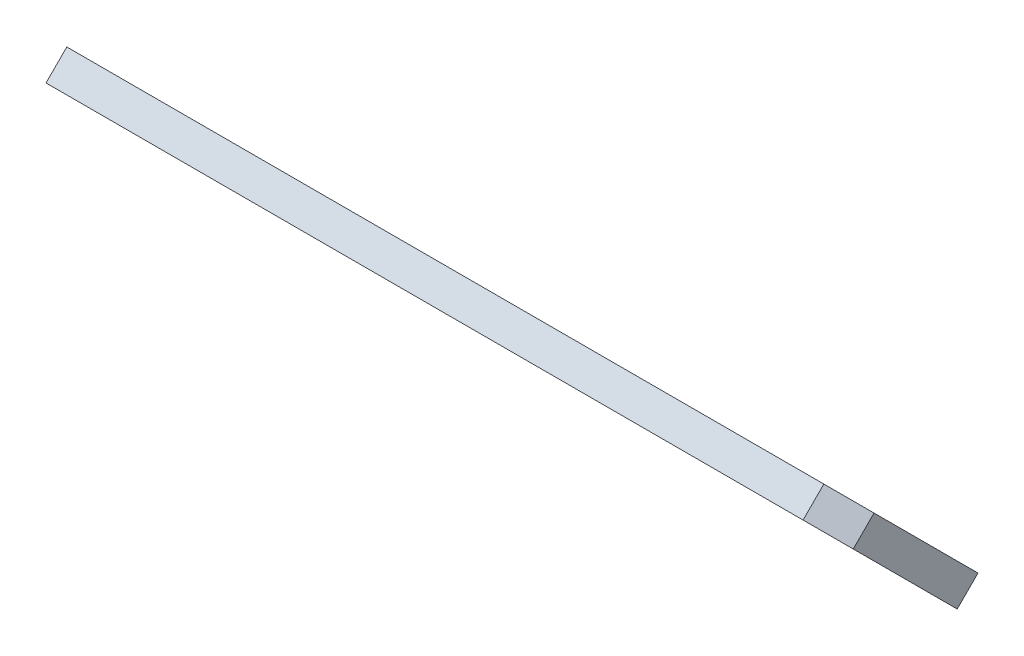
ISO-10303-21;
HEADER;
FILE_DESCRIPTION(('STEP AP214'),'2;1');
FILE_NAME('part.step','',(''),(''),'','','');
FILE_SCHEMA(('AUTOMOTIVE_DESIGN { 1 0 10303 214 1 1 1 1 }'));
ENDSEC;
DATA;
#1=APPLICATION_CONTEXT('core data for automotive mechanical design processes');
#2=APPLICATION_PROTOCOL_DEFINITION('international standard','automotive_design',2000,#1);
#3=PRODUCT_CONTEXT('',#1,'mechanical');
#4=PRODUCT('Part','Part','',(#3));
#5=PRODUCT_RELATED_PRODUCT_CATEGORY('part','',(#4));
#6=PRODUCT_DEFINITION_FORMATION('','',#4);
#7=PRODUCT_DEFINITION_CONTEXT('part definition',#1,'design');
#8=PRODUCT_DEFINITION('design','',#6,#7);
#9=PRODUCT_DEFINITION_SHAPE('','',#8);
#10=(LENGTH_UNIT() NAMED_UNIT(*) SI_UNIT(.MILLI.,.METRE.));
#11=(NAMED_UNIT(*) PLANE_ANGLE_UNIT() SI_UNIT($,.RADIAN.));
#12=(NAMED_UNIT(*) SI_UNIT($,.STERADIAN.) SOLID_ANGLE_UNIT());
#13=UNCERTAINTY_MEASURE_WITH_UNIT(LENGTH_MEASURE(1.E-05),#10,'distance_accuracy_value','');
#14=(GEOMETRIC_REPRESENTATION_CONTEXT(3) GLOBAL_UNCERTAINTY_ASSIGNED_CONTEXT((#13)) GLOBAL_UNIT_ASSIGNED_CONTEXT((#10,
#11,#12)) REPRESENTATION_CONTEXT('',''));
#15=CARTESIAN_POINT('',(0.,0.,0.));
#16=DIRECTION('',(0.,0.,1.));
#17=DIRECTION('',(1.,0.,0.));
#18=AXIS2_PLACEMENT_3D('',#15,#16,#17);
#19=CARTESIAN_POINT('',(57.85,-6.894291116569,5.621498910433));
#20=DIRECTION('',(0.,0.707106781186548,-0.707106781186548));
#21=DIRECTION('',(0.,0.707106781186548,0.707106781186548));
#22=AXIS2_PLACEMENT_3D('',#19,#20,#21);
#23=PLANE('',#22);
#24=DIRECTION('',(1.,0.,0.));
#25=VECTOR('',#24,1.);
#26=CARTESIAN_POINT('',(60.8,-7.31855518528075,5.19723484172125));
#27=LINE('',#26,#25);
#28=CARTESIAN_POINT('',(61.2,-7.31855518528075,5.19723484172125));
#29=VERTEX_POINT('',#28);
#30=CARTESIAN_POINT('',(60.4,-7.31855518528118,5.19723484172142));
#31=VERTEX_POINT('',#30);
#32=EDGE_CURVE('E60',#29,#31,#27,.F.);
#33=ORIENTED_EDGE('',*,*,#32,.F.);
#34=CARTESIAN_POINT('',(61.2,-6.8942911165687,5.6214989104327));
#35=DIRECTION('',(0.,0.707106781186048,-0.707106781187048));
#36=DIRECTION('',(0.,0.707106781187048,0.707106781186048));
#37=AXIS2_PLACEMENT_3D('',#34,#35,#36);
#38=CIRCLE('',#37,0.6);
#39=CARTESIAN_POINT('',(61.2,-6.47002704785688,6.04576297914452));
#40=VERTEX_POINT('',#39);
#41=EDGE_CURVE('E20',#29,#40,#38,.F.);
#42=ORIENTED_EDGE('',*,*,#41,.T.);
#43=DIRECTION('',(1.,0.,0.));
#44=VECTOR('',#43,1.);
#45=CARTESIAN_POINT('',(60.8,-6.4700270478575,6.0457629791445));
#46=LINE('',#45,#44);
#47=CARTESIAN_POINT('',(60.4,-6.47002704785729,6.04576297914471));
#48=VERTEX_POINT('',#47);
#49=EDGE_CURVE('E66',#40,#48,#46,.F.);
#50=ORIENTED_EDGE('',*,*,#49,.T.);
#51=CARTESIAN_POINT('',(60.4,-6.8942911165693,5.6214989104333));
#52=DIRECTION('',(0.,0.707106781186048,-0.707106781187048));
#53=DIRECTION('',(0.,0.707106781187048,0.707106781186048));
#54=AXIS2_PLACEMENT_3D('',#51,#52,#53);
#55=CIRCLE('',#54,0.6);
#56=EDGE_CURVE('E125',#48,#31,#55,.F.);
#57=ORIENTED_EDGE('',*,*,#56,.T.);
#58=EDGE_LOOP('',(#33,#42,#50,#57));
#59=FACE_BOUND('',#58,.T.);
#60=DIRECTION('',(0.,0.707106781186548,0.707106781186547));
#61=VECTOR('',#60,1.);
#62=CARTESIAN_POINT('',(63.2,-7.601397897755,4.914392129247));
#63=LINE('',#62,#61);
#64=CARTESIAN_POINT('',(63.2,-7.601397897755,4.914392129247));
#65=VERTEX_POINT('',#64);
#66=CARTESIAN_POINT('',(63.2,-6.18718433538203,6.32860569161997));
#67=VERTEX_POINT('',#66);
#68=EDGE_CURVE('E90',#65,#67,#63,.T.);
#69=ORIENTED_EDGE('',*,*,#68,.F.);
#70=DIRECTION('',(0.707106781186368,0.500000000000125,0.500000000000129));
#71=VECTOR('',#70,1.);
#72=CARTESIAN_POINT('',(62.7999999999998,-7.88424061022989,4.63154941677211));
#73=LINE('',#72,#71);
#74=CARTESIAN_POINT('',(62.8,-7.88424061022997,4.63154941677203));
#75=VERTEX_POINT('',#74);
#76=EDGE_CURVE('E92',#75,#65,#73,.T.);
#77=ORIENTED_EDGE('',*,*,#76,.F.);
#78=DIRECTION('',(1.,0.,0.));
#79=VECTOR('',#78,1.);
#80=CARTESIAN_POINT('',(57.65,-7.88424061023,4.631549416772));
#81=LINE('',#80,#79);
#82=CARTESIAN_POINT('',(52.5,-7.88424061023,4.631549416772));
#83=VERTEX_POINT('',#82);
#84=EDGE_CURVE('E74',#75,#83,#81,.F.);
#85=ORIENTED_EDGE('',*,*,#84,.T.);
#86=DIRECTION('',(0.,0.707106781186547,0.707106781186547));
#87=VECTOR('',#86,1.);
#88=CARTESIAN_POINT('',(52.5,-7.88424061023,4.631549416772));
#89=LINE('',#88,#87);
#90=CARTESIAN_POINT('',(52.5,-5.90434162290813,6.61144840409388));
#91=VERTEX_POINT('',#90);
#92=EDGE_CURVE('E119',#83,#91,#89,.T.);
#93=ORIENTED_EDGE('',*,*,#92,.T.);
#94=DIRECTION('',(1.,0.,0.));
#95=VECTOR('',#94,1.);
#96=CARTESIAN_POINT('',(57.65,-5.90434162290825,6.61144840409375));
#97=LINE('',#96,#95);
#98=CARTESIAN_POINT('',(62.8,-5.90434162290803,6.61144840409397));
#99=VERTEX_POINT('',#98);
#100=EDGE_CURVE('E145',#99,#91,#97,.F.);
#101=ORIENTED_EDGE('',*,*,#100,.F.);
#102=DIRECTION('',(-0.707106781186686,0.499999999999901,0.499999999999903));
#103=VECTOR('',#102,1.);
#104=CARTESIAN_POINT('',(63.1999999999998,-6.18718433538212,6.32860569161988));
#105=LINE('',#104,#103);
#106=EDGE_CURVE('E150',#67,#99,#105,.T.);
#107=ORIENTED_EDGE('',*,*,#106,.F.);
#108=EDGE_LOOP('',(#69,#77,#85,#93,#101,#107));
#109=FACE_BOUND('',#108,.T.);
#110=ADVANCED_FACE('F17',(#59,#109),#23,.T.);
#111=CARTESIAN_POINT('',(57.65,-8.025661966467,4.772970773009));
#112=DIRECTION('',(0.,0.707106781186548,0.707106781186548));
#113=DIRECTION('',(0.,-0.707106781186548,0.707106781186548));
#114=AXIS2_PLACEMENT_3D('',#111,#112,#113);
#115=PLANE('',#114);
#116=DIRECTION('',(-4.51028103753363E-13,0.707106781186867,-0.707106781186228));
#117=VECTOR('',#116,1.);
#118=CARTESIAN_POINT('',(62.8,-8.16708332270501,4.91439212924699));
#119=LINE('',#118,#117);
#120=CARTESIAN_POINT('',(62.8,-8.16708332270506,4.91439212924705));
#121=VERTEX_POINT('',#120);
#122=EDGE_CURVE('E97',#121,#75,#119,.T.);
#123=ORIENTED_EDGE('',*,*,#122,.F.);
#124=DIRECTION('',(1.,0.,0.));
#125=VECTOR('',#124,1.);
#126=CARTESIAN_POINT('',(57.85,-8.16708332270521,4.91439212924721));
#127=LINE('',#126,#125);
#128=CARTESIAN_POINT('',(52.5,-8.16708332270505,4.91439212924705));
#129=VERTEX_POINT('',#128);
#130=EDGE_CURVE('E126',#129,#121,#127,.T.);
#131=ORIENTED_EDGE('',*,*,#130,.F.);
#132=DIRECTION('',(0.,0.707106781186547,-0.707106781186549));
#133=VECTOR('',#132,1.);
#134=CARTESIAN_POINT('',(52.5,-8.167083322705,4.914392129247));
#135=LINE('',#134,#133);
#136=EDGE_CURVE('E105',#129,#83,#135,.T.);
#137=ORIENTED_EDGE('',*,*,#136,.T.);
#138=ORIENTED_EDGE('',*,*,#84,.F.);
#139=EDGE_LOOP('',(#123,#131,#137,#138));
#140=FACE_BOUND('',#139,.T.);
#141=ADVANCED_FACE('F101',(#140),#115,.F.);
#142=CARTESIAN_POINT('',(63.,-7.88424061023,4.914392129247));
#143=DIRECTION('',(0.70710678118673,-0.499999999999421,-0.500000000000321));
#144=DIRECTION('',(-0.577350269189774,0.,-0.816496580927622));
#145=AXIS2_PLACEMENT_3D('',#142,#143,#144);
#146=PLANE('',#145);
#147=DIRECTION('',(0.707106781186708,0.499999999999992,0.499999999999781));
#148=VECTOR('',#147,1.);
#149=CARTESIAN_POINT('',(62.8,-8.16708332270521,4.91439212924721));
#150=LINE('',#149,#148);
#151=CARTESIAN_POINT('',(63.1999999999999,-7.8842406102301,5.19723484172122));
#152=VERTEX_POINT('',#151);
#153=EDGE_CURVE('E110',#121,#152,#150,.T.);
#154=ORIENTED_EDGE('',*,*,#153,.F.);
#155=ORIENTED_EDGE('',*,*,#122,.T.);
#156=ORIENTED_EDGE('',*,*,#76,.T.);
#157=DIRECTION('',(0.,0.707106781187795,-0.7071067811853));
#158=VECTOR('',#157,1.);
#159=CARTESIAN_POINT('',(63.2,-7.88424061023,5.197234841721));
#160=LINE('',#159,#158);
#161=EDGE_CURVE('E113',#152,#65,#160,.T.);
#162=ORIENTED_EDGE('',*,*,#161,.F.);
#163=EDGE_LOOP('',(#154,#155,#156,#162));
#164=FACE_BOUND('',#163,.T.);
#165=ADVANCED_FACE('F108',(#164),#146,.T.);
#166=CARTESIAN_POINT('',(63.2,-7.035712472806,5.762920266671));
#167=DIRECTION('',(1.,0.,0.));
#168=DIRECTION('',(0.,0.,-1.));
#169=AXIS2_PLACEMENT_3D('',#166,#167,#168);
#170=PLANE('',#169);
#171=DIRECTION('',(0.,-0.707106781186698,-0.707106781186398));
#172=VECTOR('',#171,1.);
#173=CARTESIAN_POINT('',(63.2,-7.177133829044,5.904341622908));
#174=LINE('',#173,#172);
#175=CARTESIAN_POINT('',(63.2,-6.47002704785706,6.61144840409412));
#176=VERTEX_POINT('',#175);
#177=EDGE_CURVE('E158',#152,#176,#174,.F.);
#178=ORIENTED_EDGE('',*,*,#177,.F.);
#179=ORIENTED_EDGE('',*,*,#161,.T.);
#180=ORIENTED_EDGE('',*,*,#68,.T.);
#181=DIRECTION('',(-9.02056207508319E-13,0.70710678118718,-0.707106781185915));
#182=VECTOR('',#181,1.);
#183=CARTESIAN_POINT('',(63.2000000000002,-6.47002704785687,6.61144840409413));
#184=LINE('',#183,#182);
#185=EDGE_CURVE('E147',#176,#67,#184,.T.);
#186=ORIENTED_EDGE('',*,*,#185,.F.);
#187=EDGE_LOOP('',(#178,#179,#180,#186));
#188=FACE_BOUND('',#187,.T.);
#189=ADVANCED_FACE('F154',(#188),#170,.T.);
#190=CARTESIAN_POINT('',(63.,-6.187184335382,6.611448404094));
#191=DIRECTION('',(0.707106781186403,0.500000000000102,0.500000000000102));
#192=DIRECTION('',(0.577350269189783,0.,-0.816496580927615));
#193=AXIS2_PLACEMENT_3D('',#190,#191,#192);
#194=PLANE('',#193);
#195=DIRECTION('',(-0.707106781186082,0.500000000000435,0.500000000000223));
#196=VECTOR('',#195,1.);
#197=CARTESIAN_POINT('',(63.2,-6.47002704785735,6.61144840409435));
#198=LINE('',#197,#196);
#199=CARTESIAN_POINT('',(62.7999999999999,-6.18718433538219,6.89429111656895));
#200=VERTEX_POINT('',#199);
#201=EDGE_CURVE('E179',#176,#200,#198,.T.);
#202=ORIENTED_EDGE('',*,*,#201,.F.);
#203=ORIENTED_EDGE('',*,*,#185,.T.);
#204=ORIENTED_EDGE('',*,*,#106,.T.);
#205=DIRECTION('',(0.,-0.707106781185298,0.707106781187798));
#206=VECTOR('',#205,1.);
#207=CARTESIAN_POINT('',(62.8,-6.045762979145,6.752869760331));
#208=LINE('',#207,#206);
#209=EDGE_CURVE('E142',#200,#99,#208,.F.);
#210=ORIENTED_EDGE('',*,*,#209,.F.);
#211=EDGE_LOOP('',(#202,#203,#204,#210));
#212=FACE_BOUND('',#211,.T.);
#213=ADVANCED_FACE('F188',(#212),#194,.T.);
#214=CARTESIAN_POINT('',(57.65,-6.045762979145,6.752869760331));
#215=DIRECTION('',(0.,0.707106781187798,0.707106781185298));
#216=DIRECTION('',(0.,-0.707106781185298,0.707106781187798));
#217=AXIS2_PLACEMENT_3D('',#214,#215,#216);
#218=PLANE('',#217);
#219=DIRECTION('',(1.,0.,0.));
#220=VECTOR('',#219,1.);
#221=CARTESIAN_POINT('',(57.85,-6.18718433538229,6.89429111656929));
#222=LINE('',#221,#220);
#223=CARTESIAN_POINT('',(52.5,-6.1871843353822,6.89429111656895));
#224=VERTEX_POINT('',#223);
#225=EDGE_CURVE('E175',#200,#224,#222,.F.);
#226=ORIENTED_EDGE('',*,*,#225,.F.);
#227=ORIENTED_EDGE('',*,*,#209,.T.);
#228=ORIENTED_EDGE('',*,*,#100,.T.);
#229=DIRECTION('',(0.,-0.707106781185299,0.707106781187797));
#230=VECTOR('',#229,1.);
#231=CARTESIAN_POINT('',(52.5,-5.904341622908,6.611448404094));
#232=LINE('',#231,#230);
#233=EDGE_CURVE('E139',#91,#224,#232,.T.);
#234=ORIENTED_EDGE('',*,*,#233,.T.);
#235=EDGE_LOOP('',(#226,#227,#228,#234));
#236=FACE_BOUND('',#235,.T.);
#237=ADVANCED_FACE('F190',(#236),#218,.T.);
#238=CARTESIAN_POINT('',(52.5,-7.035712472806,5.76292026667));
#239=DIRECTION('',(1.,0.,0.));
#240=DIRECTION('',(0.,0.,-1.));
#241=AXIS2_PLACEMENT_3D('',#238,#239,#240);
#242=PLANE('',#241);
#243=ORIENTED_EDGE('',*,*,#136,.F.);
#244=DIRECTION('',(0.,-0.707106781186698,-0.707106781186398));
#245=VECTOR('',#244,1.);
#246=CARTESIAN_POINT('',(52.5,-7.177133829044,5.904341622908));
#247=LINE('',#246,#245);
#248=EDGE_CURVE('E170',#224,#129,#247,.T.);
#249=ORIENTED_EDGE('',*,*,#248,.F.);
#250=ORIENTED_EDGE('',*,*,#233,.F.);
#251=ORIENTED_EDGE('',*,*,#92,.F.);
#252=EDGE_LOOP('',(#243,#249,#250,#251));
#253=FACE_BOUND('',#252,.T.);
#254=ADVANCED_FACE('F168',(#253),#242,.F.);
#255=CARTESIAN_POINT('',(60.8,-6.611448404095,6.187184335382));
#256=DIRECTION('',(0.,0.707106781186548,0.707106781186548));
#257=DIRECTION('',(0.,-0.707106781186548,0.707106781186548));
#258=AXIS2_PLACEMENT_3D('',#255,#256,#257);
#259=PLANE('',#258);
#260=DIRECTION('',(0.,0.707106781186048,-0.707106781187048));
#261=VECTOR('',#260,1.);
#262=CARTESIAN_POINT('',(61.2,-6.47002704785677,6.04576297914463));
#263=LINE('',#262,#261);
#264=CARTESIAN_POINT('',(61.2,-6.75286976033194,6.32860569162006));
#265=VERTEX_POINT('',#264);
#266=EDGE_CURVE('E118',#40,#265,#263,.F.);
#267=ORIENTED_EDGE('',*,*,#266,.T.);
#268=DIRECTION('',(1.,0.,0.));
#269=VECTOR('',#268,1.);
#270=CARTESIAN_POINT('',(57.85,-6.75286976033191,6.32860569161991));
#271=LINE('',#270,#269);
#272=CARTESIAN_POINT('',(60.4,-6.75286976033137,6.32860569161944));
#273=VERTEX_POINT('',#272);
#274=EDGE_CURVE('E124',#273,#265,#271,.T.);
#275=ORIENTED_EDGE('',*,*,#274,.F.);
#276=DIRECTION('',(0.,0.707106781186048,-0.707106781187048));
#277=VECTOR('',#276,1.);
#278=CARTESIAN_POINT('',(60.4,-6.47002704785677,6.04576297914463));
#279=LINE('',#278,#277);
#280=EDGE_CURVE('E127',#273,#48,#279,.T.);
#281=ORIENTED_EDGE('',*,*,#280,.T.);
#282=ORIENTED_EDGE('',*,*,#49,.F.);
#283=EDGE_LOOP('',(#267,#275,#281,#282));
#284=FACE_BOUND('',#283,.T.);
#285=ADVANCED_FACE('F199',(#284),#259,.F.);
#286=CARTESIAN_POINT('',(61.2,-6.894291116569,5.621498910433));
#287=DIRECTION('',(0.,0.707106781186048,-0.707106781187048));
#288=DIRECTION('',(0.,0.707106781187048,0.707106781186048));
#289=AXIS2_PLACEMENT_3D('',#286,#287,#288);
#290=CYLINDRICAL_SURFACE('',#289,0.6);
#291=DIRECTION('',(0.,-0.707106781185298,0.707106781187798));
#292=VECTOR('',#291,1.);
#293=CARTESIAN_POINT('',(61.2,-7.459976541518,5.338656197959));
#294=LINE('',#293,#292);
#295=CARTESIAN_POINT('',(61.2,-7.60139789775566,5.48007755419703));
#296=VERTEX_POINT('',#295);
#297=EDGE_CURVE('E120',#296,#29,#294,.F.);
#298=ORIENTED_EDGE('',*,*,#297,.F.);
#299=CARTESIAN_POINT('',(61.2,-7.1771338290441,5.9043416229085));
#300=DIRECTION('',(0.,0.707106781186048,-0.707106781187048));
#301=DIRECTION('',(0.,0.707106781187048,0.707106781186048));
#302=AXIS2_PLACEMENT_3D('',#299,#300,#301);
#303=CIRCLE('',#302,0.6);
#304=EDGE_CURVE('E122',#265,#296,#303,.T.);
#305=ORIENTED_EDGE('',*,*,#304,.F.);
#306=ORIENTED_EDGE('',*,*,#266,.F.);
#307=ORIENTED_EDGE('',*,*,#41,.F.);
#308=EDGE_LOOP('',(#298,#305,#306,#307));
#309=FACE_BOUND('',#308,.T.);
#310=ADVANCED_FACE('F216',(#309),#290,.F.);
#311=CARTESIAN_POINT('',(60.8,-7.459976541518,5.338656197959));
#312=DIRECTION('',(0.,0.707106781187798,0.707106781185298));
#313=DIRECTION('',(0.,-0.707106781185298,0.707106781187798));
#314=AXIS2_PLACEMENT_3D('',#311,#312,#313);
#315=PLANE('',#314);
#316=DIRECTION('',(1.,0.,0.));
#317=VECTOR('',#316,1.);
#318=CARTESIAN_POINT('',(57.85,-7.60139789775559,5.48007755419659));
#319=LINE('',#318,#317);
#320=CARTESIAN_POINT('',(60.4,-7.60139789775535,5.48007755419624));
#321=VERTEX_POINT('',#320);
#322=EDGE_CURVE('E26',#296,#321,#319,.F.);
#323=ORIENTED_EDGE('',*,*,#322,.F.);
#324=ORIENTED_EDGE('',*,*,#297,.T.);
#325=ORIENTED_EDGE('',*,*,#32,.T.);
#326=DIRECTION('',(0.,0.707106781186048,-0.707106781187048));
#327=VECTOR('',#326,1.);
#328=CARTESIAN_POINT('',(60.4,-7.31855518528123,5.19723484172137));
#329=LINE('',#328,#327);
#330=EDGE_CURVE('E35',#31,#321,#329,.F.);
#331=ORIENTED_EDGE('',*,*,#330,.T.);
#332=EDGE_LOOP('',(#323,#324,#325,#331));
#333=FACE_BOUND('',#332,.T.);
#334=ADVANCED_FACE('F209',(#333),#315,.T.);
#335=CARTESIAN_POINT('',(60.4,-6.894291116569,5.621498910433));
#336=DIRECTION('',(0.,0.707106781186048,-0.707106781187048));
#337=DIRECTION('',(0.,0.707106781187048,0.707106781186048));
#338=AXIS2_PLACEMENT_3D('',#335,#336,#337);
#339=CYLINDRICAL_SURFACE('',#338,0.6);
#340=ORIENTED_EDGE('',*,*,#280,.F.);
#341=CARTESIAN_POINT('',(60.4,-7.177133829043,5.9043416229074));
#342=DIRECTION('',(0.,0.707106781186048,-0.707106781187048));
#343=DIRECTION('',(0.,0.707106781187048,0.707106781186048));
#344=AXIS2_PLACEMENT_3D('',#341,#342,#343);
#345=CIRCLE('',#344,0.6);
#346=EDGE_CURVE('E11',#321,#273,#345,.T.);
#347=ORIENTED_EDGE('',*,*,#346,.F.);
#348=ORIENTED_EDGE('',*,*,#330,.F.);
#349=ORIENTED_EDGE('',*,*,#56,.F.);
#350=EDGE_LOOP('',(#340,#347,#348,#349));
#351=FACE_BOUND('',#350,.T.);
#352=ADVANCED_FACE('F203',(#351),#339,.F.);
#353=CARTESIAN_POINT('',(57.85,-7.177133829044,5.904341622908));
#354=DIRECTION('',(0.,-0.707106781186398,0.707106781186698));
#355=DIRECTION('',(0.,-0.707106781186698,-0.707106781186398));
#356=AXIS2_PLACEMENT_3D('',#353,#354,#355);
#357=PLANE('',#356);
#358=ORIENTED_EDGE('',*,*,#322,.T.);
#359=ORIENTED_EDGE('',*,*,#346,.T.);
#360=ORIENTED_EDGE('',*,*,#274,.T.);
#361=ORIENTED_EDGE('',*,*,#304,.T.);
#362=EDGE_LOOP('',(#358,#359,#360,#361));
#363=FACE_BOUND('',#362,.T.);
#364=ORIENTED_EDGE('',*,*,#225,.T.);
#365=ORIENTED_EDGE('',*,*,#248,.T.);
#366=ORIENTED_EDGE('',*,*,#130,.T.);
#367=ORIENTED_EDGE('',*,*,#153,.T.);
#368=ORIENTED_EDGE('',*,*,#177,.T.);
#369=ORIENTED_EDGE('',*,*,#201,.T.);
#370=EDGE_LOOP('',(#364,#365,#366,#367,#368,#369));
#371=FACE_BOUND('',#370,.T.);
#372=ADVANCED_FACE('F172',(#363,#371),#357,.T.);
#373=CLOSED_SHELL('',(#110,#141,#165,#189,#213,#237,#254,#285,#310,#334,#352,#372));
#374=MANIFOLD_SOLID_BREP('B1',#373);
#375=ADVANCED_BREP_SHAPE_REPRESENTATION('',(#18,#374),#14);
#376=SHAPE_DEFINITION_REPRESENTATION(#9,#375);
ENDSEC;
END-ISO-10303-21;
